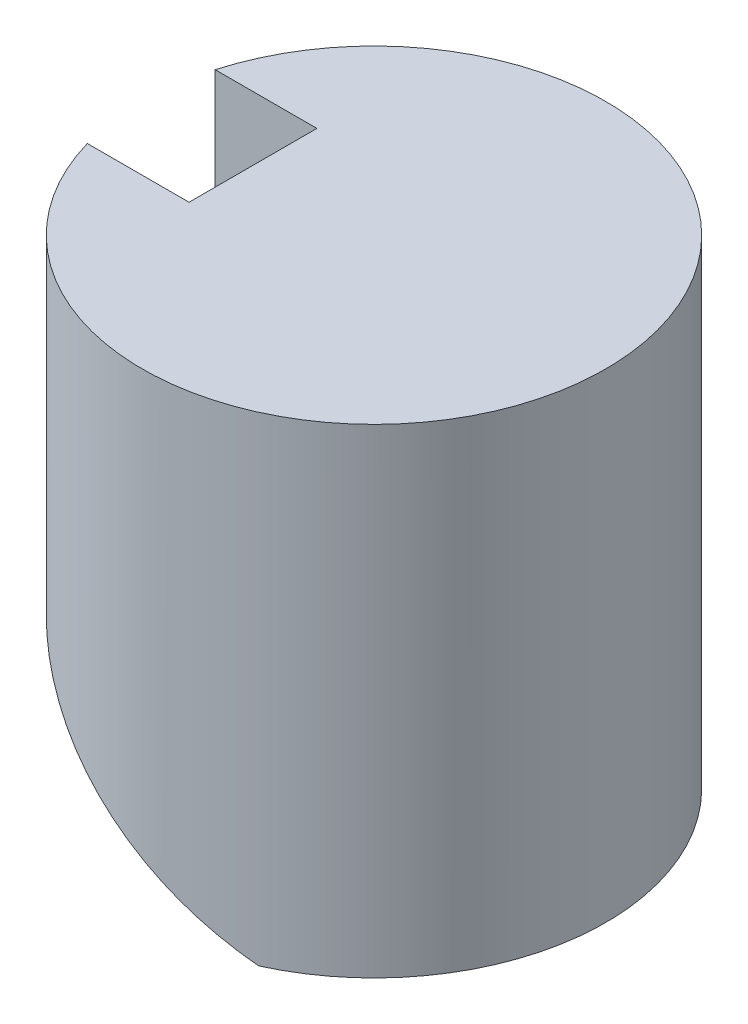
ISO-10303-21;
HEADER;
FILE_DESCRIPTION(('STEP AP214'),'2;1');
FILE_NAME('part.step','',(''),(''),'','','');
FILE_SCHEMA(('AUTOMOTIVE_DESIGN { 1 0 10303 214 1 1 1 1 }'));
ENDSEC;
DATA;
#1=APPLICATION_CONTEXT('core data for automotive mechanical design processes');
#2=APPLICATION_PROTOCOL_DEFINITION('international standard','automotive_design',2000,#1);
#3=PRODUCT_CONTEXT('',#1,'mechanical');
#4=PRODUCT('Part','Part','',(#3));
#5=PRODUCT_RELATED_PRODUCT_CATEGORY('part','',(#4));
#6=PRODUCT_DEFINITION_FORMATION('','',#4);
#7=PRODUCT_DEFINITION_CONTEXT('part definition',#1,'design');
#8=PRODUCT_DEFINITION('design','',#6,#7);
#9=PRODUCT_DEFINITION_SHAPE('','',#8);
#10=(LENGTH_UNIT() NAMED_UNIT(*) SI_UNIT(.MILLI.,.METRE.));
#11=(NAMED_UNIT(*) PLANE_ANGLE_UNIT() SI_UNIT($,.RADIAN.));
#12=(NAMED_UNIT(*) SI_UNIT($,.STERADIAN.) SOLID_ANGLE_UNIT());
#13=UNCERTAINTY_MEASURE_WITH_UNIT(LENGTH_MEASURE(1.E-05),#10,'distance_accuracy_value','');
#14=(GEOMETRIC_REPRESENTATION_CONTEXT(3) GLOBAL_UNCERTAINTY_ASSIGNED_CONTEXT((#13)) GLOBAL_UNIT_ASSIGNED_CONTEXT((#10,
#11,#12)) REPRESENTATION_CONTEXT('',''));
#15=CARTESIAN_POINT('',(0.,0.,0.));
#16=DIRECTION('',(0.,0.,1.));
#17=DIRECTION('',(1.,0.,0.));
#18=AXIS2_PLACEMENT_3D('',#15,#16,#17);
#19=CARTESIAN_POINT('',(0.,60.,0.));
#20=DIRECTION('',(0.,-1.,0.));
#21=DIRECTION('',(0.,0.,-1.));
#22=AXIS2_PLACEMENT_3D('',#19,#20,#21);
#23=CYLINDRICAL_SURFACE('',#22,29.);
#24=CARTESIAN_POINT('',(0.,60.,0.));
#25=DIRECTION('',(0.,1.,0.));
#26=DIRECTION('',(0.,0.,1.));
#27=AXIS2_PLACEMENT_3D('',#24,#25,#26);
#28=CIRCLE('',#27,29.);
#29=CARTESIAN_POINT('',(-27.8747197295327,60.,8.));
#30=VERTEX_POINT('',#29);
#31=CARTESIAN_POINT('',(-27.8747197295327,60.,-8.));
#32=VERTEX_POINT('',#31);
#33=EDGE_CURVE('E49',#30,#32,#28,.T.);
#34=ORIENTED_EDGE('',*,*,#33,.F.);
#35=DIRECTION('',(0.,-1.,0.));
#36=VECTOR('',#35,1.);
#37=CARTESIAN_POINT('',(-27.8747197295327,81.0216801697063,8.));
#38=LINE('',#37,#36);
#39=CARTESIAN_POINT('',(-27.8747197295327,23.0216801697063,8.));
#40=VERTEX_POINT('',#39);
#41=EDGE_CURVE('E121',#30,#40,#38,.T.);
#42=ORIENTED_EDGE('',*,*,#41,.T.);
#43=CARTESIAN_POINT('',(0.,6.92820323027541,0.));
#44=DIRECTION('',(0.499999999999995,0.866025403784442,0.));
#45=DIRECTION('',(0.866025403784442,-0.499999999999995,0.));
#46=AXIS2_PLACEMENT_3D('',#43,#44,#45);
#47=ELLIPSE('',#46,33.4863156129982,29.);
#48=CARTESIAN_POINT('',(12.,0.,26.4007575648882));
#49=VERTEX_POINT('',#48);
#50=EDGE_CURVE('E42',#40,#49,#47,.T.);
#51=ORIENTED_EDGE('',*,*,#50,.T.);
#52=CARTESIAN_POINT('',(0.,0.,0.));
#53=DIRECTION('',(0.,1.,0.));
#54=DIRECTION('',(0.,0.,1.));
#55=AXIS2_PLACEMENT_3D('',#52,#53,#54);
#56=CIRCLE('',#55,29.);
#57=CARTESIAN_POINT('',(12.,0.,-26.4007575648882));
#58=VERTEX_POINT('',#57);
#59=EDGE_CURVE('E136',#49,#58,#56,.T.);
#60=ORIENTED_EDGE('',*,*,#59,.T.);
#61=CARTESIAN_POINT('',(-27.8747197295327,23.0216801697063,-8.));
#62=VERTEX_POINT('',#61);
#63=EDGE_CURVE('E64',#58,#62,#47,.T.);
#64=ORIENTED_EDGE('',*,*,#63,.T.);
#65=DIRECTION('',(0.,-1.,0.));
#66=VECTOR('',#65,1.);
#67=CARTESIAN_POINT('',(-27.8747197295327,81.0216801697063,-8.));
#68=LINE('',#67,#66);
#69=EDGE_CURVE('E57',#32,#62,#68,.T.);
#70=ORIENTED_EDGE('',*,*,#69,.F.);
#71=EDGE_LOOP('',(#34,#42,#51,#60,#64,#70));
#72=FACE_BOUND('',#71,.T.);
#73=ADVANCED_FACE('F39',(#72),#23,.T.);
#74=CARTESIAN_POINT('',(0.,60.,0.));
#75=DIRECTION('',(0.,1.,0.));
#76=DIRECTION('',(0.,0.,1.));
#77=AXIS2_PLACEMENT_3D('',#74,#75,#76);
#78=PLANE('',#77);
#79=DIRECTION('',(1.,0.,0.));
#80=VECTOR('',#79,1.);
#81=CARTESIAN_POINT('',(0.,60.,8.00000000000001));
#82=LINE('',#81,#80);
#83=CARTESIAN_POINT('',(-15.1435935394489,60.,8.));
#84=VERTEX_POINT('',#83);
#85=EDGE_CURVE('E145',#30,#84,#82,.T.);
#86=ORIENTED_EDGE('',*,*,#85,.F.);
#87=ORIENTED_EDGE('',*,*,#33,.T.);
#88=DIRECTION('',(-1.,0.,0.));
#89=VECTOR('',#88,1.);
#90=CARTESIAN_POINT('',(0.,60.,-7.99999999999999));
#91=LINE('',#90,#89);
#92=CARTESIAN_POINT('',(-15.1435935394489,60.,-8.));
#93=VERTEX_POINT('',#92);
#94=EDGE_CURVE('E125',#93,#32,#91,.T.);
#95=ORIENTED_EDGE('',*,*,#94,.F.);
#96=DIRECTION('',(0.,0.,-1.));
#97=VECTOR('',#96,1.);
#98=CARTESIAN_POINT('',(-15.1435935394489,60.,0.));
#99=LINE('',#98,#97);
#100=EDGE_CURVE('E97',#84,#93,#99,.T.);
#101=ORIENTED_EDGE('',*,*,#100,.F.);
#102=EDGE_LOOP('',(#86,#87,#95,#101));
#103=FACE_BOUND('',#102,.T.);
#104=ADVANCED_FACE('F163',(#103),#78,.T.);
#105=CARTESIAN_POINT('',(0.,0.,0.));
#106=DIRECTION('',(0.,1.,0.));
#107=DIRECTION('',(0.,0.,1.));
#108=AXIS2_PLACEMENT_3D('',#105,#106,#107);
#109=PLANE('',#108);
#110=CARTESIAN_POINT('',(21.,0.,0.));
#111=DIRECTION('',(0.,-1.,0.));
#112=DIRECTION('',(0.,0.,-1.));
#113=AXIS2_PLACEMENT_3D('',#110,#111,#112);
#114=CIRCLE('',#113,3.5);
#115=CARTESIAN_POINT('',(21.,0.,-3.5));
#116=VERTEX_POINT('',#115);
#117=EDGE_CURVE('E116',#116,#116,#114,.T.);
#118=ORIENTED_EDGE('',*,*,#117,.F.);
#119=EDGE_LOOP('',(#118));
#120=FACE_BOUND('',#119,.T.);
#121=ORIENTED_EDGE('',*,*,#59,.F.);
#122=DIRECTION('',(0.,0.,-1.));
#123=VECTOR('',#122,1.);
#124=CARTESIAN_POINT('',(12.,0.,0.));
#125=LINE('',#124,#123);
#126=EDGE_CURVE('E11',#49,#58,#125,.T.);
#127=ORIENTED_EDGE('',*,*,#126,.T.);
#128=EDGE_LOOP('',(#121,#127));
#129=FACE_BOUND('',#128,.T.);
#130=ADVANCED_FACE('F160',(#120,#129),#109,.F.);
#131=CARTESIAN_POINT('',(12.,0.,-29.));
#132=DIRECTION('',(0.499999999999995,0.866025403784442,0.));
#133=DIRECTION('',(-0.866025403784442,0.499999999999995,0.));
#134=AXIS2_PLACEMENT_3D('',#131,#132,#133);
#135=PLANE('',#134);
#136=ORIENTED_EDGE('',*,*,#50,.F.);
#137=DIRECTION('',(-0.866025403784442,0.499999999999995,0.));
#138=VECTOR('',#137,1.);
#139=CARTESIAN_POINT('',(-15.1435935394489,15.6713610367744,8.));
#140=LINE('',#139,#138);
#141=CARTESIAN_POINT('',(-15.1435935394489,15.6713610367744,8.));
#142=VERTEX_POINT('',#141);
#143=EDGE_CURVE('E109',#142,#40,#140,.T.);
#144=ORIENTED_EDGE('',*,*,#143,.F.);
#145=DIRECTION('',(0.,0.,1.));
#146=VECTOR('',#145,1.);
#147=CARTESIAN_POINT('',(-15.1435935394489,15.6713610367744,-8.));
#148=LINE('',#147,#146);
#149=CARTESIAN_POINT('',(-15.1435935394489,15.6713610367744,-8.));
#150=VERTEX_POINT('',#149);
#151=EDGE_CURVE('E94',#150,#142,#148,.T.);
#152=ORIENTED_EDGE('',*,*,#151,.F.);
#153=DIRECTION('',(0.866025403784442,-0.499999999999995,0.));
#154=VECTOR('',#153,1.);
#155=CARTESIAN_POINT('',(-27.8747197295327,23.0216801697063,-8.));
#156=LINE('',#155,#154);
#157=EDGE_CURVE('E102',#62,#150,#156,.T.);
#158=ORIENTED_EDGE('',*,*,#157,.F.);
#159=ORIENTED_EDGE('',*,*,#63,.F.);
#160=ORIENTED_EDGE('',*,*,#126,.F.);
#161=EDGE_LOOP('',(#136,#144,#152,#158,#159,#160));
#162=FACE_BOUND('',#161,.T.);
#163=ADVANCED_FACE('F108',(#162),#135,.F.);
#164=CARTESIAN_POINT('',(-15.1435935394489,73.6713610367744,8.));
#165=DIRECTION('',(0.,0.,1.));
#166=DIRECTION('',(1.,0.,0.));
#167=AXIS2_PLACEMENT_3D('',#164,#165,#166);
#168=PLANE('',#167);
#169=ORIENTED_EDGE('',*,*,#85,.T.);
#170=DIRECTION('',(0.,-1.,0.));
#171=VECTOR('',#170,1.);
#172=CARTESIAN_POINT('',(-15.1435935394489,73.6713610367744,8.));
#173=LINE('',#172,#171);
#174=EDGE_CURVE('E100',#84,#142,#173,.T.);
#175=ORIENTED_EDGE('',*,*,#174,.T.);
#176=ORIENTED_EDGE('',*,*,#143,.T.);
#177=ORIENTED_EDGE('',*,*,#41,.F.);
#178=EDGE_LOOP('',(#169,#175,#176,#177));
#179=FACE_BOUND('',#178,.T.);
#180=ADVANCED_FACE('F169',(#179),#168,.F.);
#181=CARTESIAN_POINT('',(-15.1435935394489,73.6713610367744,-8.));
#182=DIRECTION('',(1.,0.,0.));
#183=DIRECTION('',(0.,0.,-1.));
#184=AXIS2_PLACEMENT_3D('',#181,#182,#183);
#185=PLANE('',#184);
#186=ORIENTED_EDGE('',*,*,#100,.T.);
#187=DIRECTION('',(0.,-1.,0.));
#188=VECTOR('',#187,1.);
#189=CARTESIAN_POINT('',(-15.1435935394489,73.6713610367744,-8.));
#190=LINE('',#189,#188);
#191=EDGE_CURVE('E90',#93,#150,#190,.T.);
#192=ORIENTED_EDGE('',*,*,#191,.T.);
#193=ORIENTED_EDGE('',*,*,#151,.T.);
#194=ORIENTED_EDGE('',*,*,#174,.F.);
#195=EDGE_LOOP('',(#186,#192,#193,#194));
#196=FACE_BOUND('',#195,.T.);
#197=ADVANCED_FACE('F91',(#196),#185,.F.);
#198=CARTESIAN_POINT('',(-27.8747197295327,81.0216801697063,-8.));
#199=DIRECTION('',(0.,0.,-1.));
#200=DIRECTION('',(-1.,0.,0.));
#201=AXIS2_PLACEMENT_3D('',#198,#199,#200);
#202=PLANE('',#201);
#203=ORIENTED_EDGE('',*,*,#94,.T.);
#204=ORIENTED_EDGE('',*,*,#69,.T.);
#205=ORIENTED_EDGE('',*,*,#157,.T.);
#206=ORIENTED_EDGE('',*,*,#191,.F.);
#207=EDGE_LOOP('',(#203,#204,#205,#206));
#208=FACE_BOUND('',#207,.T.);
#209=ADVANCED_FACE('F103',(#208),#202,.F.);
#210=CARTESIAN_POINT('',(21.,20.,0.));
#211=DIRECTION('',(0.,-1.,0.));
#212=DIRECTION('',(0.,0.,-1.));
#213=AXIS2_PLACEMENT_3D('',#210,#211,#212);
#214=CYLINDRICAL_SURFACE('',#213,3.5);
#215=CARTESIAN_POINT('',(21.,20.,0.));
#216=DIRECTION('',(0.,-1.,0.));
#217=DIRECTION('',(0.,0.,-1.));
#218=AXIS2_PLACEMENT_3D('',#215,#216,#217);
#219=CIRCLE('',#218,3.5);
#220=CARTESIAN_POINT('',(21.,20.,-3.5));
#221=VERTEX_POINT('',#220);
#222=EDGE_CURVE('E105',#221,#221,#219,.T.);
#223=ORIENTED_EDGE('',*,*,#222,.F.);
#224=EDGE_LOOP('',(#223));
#225=FACE_BOUND('',#224,.T.);
#226=ORIENTED_EDGE('',*,*,#117,.T.);
#227=EDGE_LOOP('',(#226));
#228=FACE_BOUND('',#227,.T.);
#229=ADVANCED_FACE('F212',(#225,#228),#214,.F.);
#230=CARTESIAN_POINT('',(21.,20.,0.));
#231=DIRECTION('',(0.,-1.,0.));
#232=DIRECTION('',(0.,0.,-1.));
#233=AXIS2_PLACEMENT_3D('',#230,#231,#232);
#234=PLANE('',#233);
#235=ORIENTED_EDGE('',*,*,#222,.T.);
#236=EDGE_LOOP('',(#235));
#237=FACE_BOUND('',#236,.T.);
#238=ADVANCED_FACE('F225',(#237),#234,.T.);
#239=CLOSED_SHELL('',(#73,#104,#130,#163,#180,#197,#209,#229,#238));
#240=MANIFOLD_SOLID_BREP('B2',#239);
#241=ADVANCED_BREP_SHAPE_REPRESENTATION('',(#18,#240),#14);
#242=SHAPE_DEFINITION_REPRESENTATION(#9,#241);
ENDSEC;
END-ISO-10303-21;
